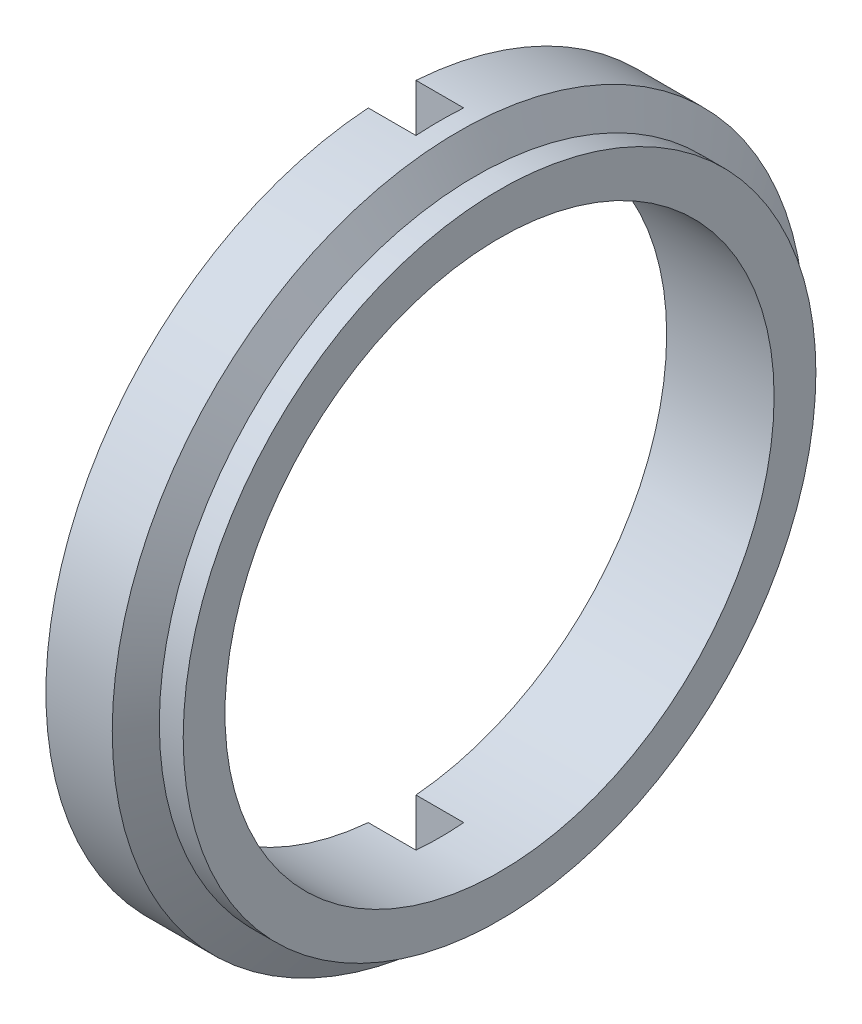
ISO-10303-21;
HEADER;
FILE_DESCRIPTION(('STEP AP214'),'2;1');
FILE_NAME('part.step','',(''),(''),'','','');
FILE_SCHEMA(('AUTOMOTIVE_DESIGN { 1 0 10303 214 1 1 1 1 }'));
ENDSEC;
DATA;
#1=APPLICATION_CONTEXT('core data for automotive mechanical design processes');
#2=APPLICATION_PROTOCOL_DEFINITION('international standard','automotive_design',2000,#1);
#3=PRODUCT_CONTEXT('',#1,'mechanical');
#4=PRODUCT('Part','Part','',(#3));
#5=PRODUCT_RELATED_PRODUCT_CATEGORY('part','',(#4));
#6=PRODUCT_DEFINITION_FORMATION('','',#4);
#7=PRODUCT_DEFINITION_CONTEXT('part definition',#1,'design');
#8=PRODUCT_DEFINITION('design','',#6,#7);
#9=PRODUCT_DEFINITION_SHAPE('','',#8);
#10=(LENGTH_UNIT() NAMED_UNIT(*) SI_UNIT(.MILLI.,.METRE.));
#11=(NAMED_UNIT(*) PLANE_ANGLE_UNIT() SI_UNIT($,.RADIAN.));
#12=(NAMED_UNIT(*) SI_UNIT($,.STERADIAN.) SOLID_ANGLE_UNIT());
#13=UNCERTAINTY_MEASURE_WITH_UNIT(LENGTH_MEASURE(1.E-05),#10,'distance_accuracy_value','');
#14=(GEOMETRIC_REPRESENTATION_CONTEXT(3) GLOBAL_UNCERTAINTY_ASSIGNED_CONTEXT((#13)) GLOBAL_UNIT_ASSIGNED_CONTEXT((#10,
#11,#12)) REPRESENTATION_CONTEXT('',''));
#15=CARTESIAN_POINT('',(0.,0.,0.));
#16=DIRECTION('',(0.,0.,1.));
#17=DIRECTION('',(1.,0.,0.));
#18=AXIS2_PLACEMENT_3D('',#15,#16,#17);
#19=CARTESIAN_POINT('',(-4.5,11.5,0.));
#20=DIRECTION('',(-1.,0.,0.));
#21=DIRECTION('',(0.,0.,1.));
#22=AXIS2_PLACEMENT_3D('',#19,#20,#21);
#23=PLANE('',#22);
#24=DIRECTION('',(0.,-1.,0.));
#25=VECTOR('',#24,1.);
#26=CARTESIAN_POINT('',(-4.5,-15.0577473688367,-0.999999999999998));
#27=LINE('',#26,#25);
#28=CARTESIAN_POINT('',(-4.5,14.4654761414894,-1.));
#29=VERTEX_POINT('',#28);
#30=CARTESIAN_POINT('',(-4.5,11.4564392373896,-1.));
#31=VERTEX_POINT('',#30);
#32=EDGE_CURVE('E97',#29,#31,#27,.T.);
#33=ORIENTED_EDGE('',*,*,#32,.F.);
#34=CARTESIAN_POINT('',(-4.5,0.,0.));
#35=DIRECTION('',(1.,0.,0.));
#36=DIRECTION('',(0.,0.,-1.));
#37=AXIS2_PLACEMENT_3D('',#34,#35,#36);
#38=CIRCLE('',#37,14.5);
#39=CARTESIAN_POINT('',(-4.5,-14.4654761414894,-0.999999999999998));
#40=VERTEX_POINT('',#39);
#41=EDGE_CURVE('E111',#40,#29,#38,.T.);
#42=ORIENTED_EDGE('',*,*,#41,.F.);
#43=CARTESIAN_POINT('',(-4.5,-11.4564392373896,-0.999999999999999));
#44=VERTEX_POINT('',#43);
#45=EDGE_CURVE('E115',#44,#40,#27,.T.);
#46=ORIENTED_EDGE('',*,*,#45,.F.);
#47=CARTESIAN_POINT('',(-4.5,0.,0.));
#48=DIRECTION('',(1.,0.,0.));
#49=DIRECTION('',(0.,0.,-1.));
#50=AXIS2_PLACEMENT_3D('',#47,#48,#49);
#51=CIRCLE('',#50,11.5);
#52=EDGE_CURVE('E113',#44,#31,#51,.T.);
#53=ORIENTED_EDGE('',*,*,#52,.T.);
#54=EDGE_LOOP('',(#33,#42,#46,#53));
#55=FACE_BOUND('',#54,.T.);
#56=ADVANCED_FACE('F30',(#55),#23,.T.);
#57=CARTESIAN_POINT('',(0.,13.25,0.));
#58=DIRECTION('',(1.,0.,0.));
#59=DIRECTION('',(0.,0.,-1.));
#60=AXIS2_PLACEMENT_3D('',#57,#58,#59);
#61=PLANE('',#60);
#62=CARTESIAN_POINT('',(0.,0.,0.));
#63=DIRECTION('',(1.,0.,0.));
#64=DIRECTION('',(0.,0.,-1.));
#65=AXIS2_PLACEMENT_3D('',#62,#63,#64);
#66=CIRCLE('',#65,13.25);
#67=CARTESIAN_POINT('',(0.,0.,-13.25));
#68=VERTEX_POINT('',#67);
#69=EDGE_CURVE('E170',#68,#68,#66,.T.);
#70=ORIENTED_EDGE('',*,*,#69,.T.);
#71=EDGE_LOOP('',(#70));
#72=FACE_BOUND('',#71,.T.);
#73=CARTESIAN_POINT('',(0.,0.,0.));
#74=DIRECTION('',(1.,0.,0.));
#75=DIRECTION('',(0.,0.,-1.));
#76=AXIS2_PLACEMENT_3D('',#73,#74,#75);
#77=CIRCLE('',#76,11.5);
#78=CARTESIAN_POINT('',(0.,0.,-11.5));
#79=VERTEX_POINT('',#78);
#80=EDGE_CURVE('E132',#79,#79,#77,.T.);
#81=ORIENTED_EDGE('',*,*,#80,.F.);
#82=EDGE_LOOP('',(#81));
#83=FACE_BOUND('',#82,.T.);
#84=ADVANCED_FACE('F32',(#72,#83),#61,.T.);
#85=CARTESIAN_POINT('',(0.,0.,0.));
#86=DIRECTION('',(1.,0.,0.));
#87=DIRECTION('',(0.,0.,-1.));
#88=AXIS2_PLACEMENT_3D('',#85,#86,#87);
#89=CYLINDRICAL_SURFACE('',#88,11.5);
#90=DIRECTION('',(1.,0.,0.));
#91=VECTOR('',#90,1.);
#92=CARTESIAN_POINT('',(0.,11.4564392373896,-1.));
#93=LINE('',#92,#91);
#94=CARTESIAN_POINT('',(-2.5,11.4564392373896,-1.));
#95=VERTEX_POINT('',#94);
#96=EDGE_CURVE('E168',#31,#95,#93,.T.);
#97=ORIENTED_EDGE('',*,*,#96,.F.);
#98=ORIENTED_EDGE('',*,*,#52,.F.);
#99=DIRECTION('',(1.,0.,0.));
#100=VECTOR('',#99,1.);
#101=CARTESIAN_POINT('',(0.,-11.4564392373896,-0.999999999999999));
#102=LINE('',#101,#100);
#103=CARTESIAN_POINT('',(-2.5,-11.4564392373896,-0.999999999999999));
#104=VERTEX_POINT('',#103);
#105=EDGE_CURVE('E166',#104,#44,#102,.F.);
#106=ORIENTED_EDGE('',*,*,#105,.F.);
#107=CARTESIAN_POINT('',(-2.5,0.,0.));
#108=DIRECTION('',(1.,0.,0.));
#109=DIRECTION('',(0.,0.,-1.));
#110=AXIS2_PLACEMENT_3D('',#107,#108,#109);
#111=CIRCLE('',#110,11.5);
#112=CARTESIAN_POINT('',(-2.5,-11.4564392373896,1.));
#113=VERTEX_POINT('',#112);
#114=EDGE_CURVE('E148',#113,#104,#111,.T.);
#115=ORIENTED_EDGE('',*,*,#114,.F.);
#116=DIRECTION('',(1.,0.,0.));
#117=VECTOR('',#116,1.);
#118=CARTESIAN_POINT('',(0.,-11.4564392373896,1.));
#119=LINE('',#118,#117);
#120=CARTESIAN_POINT('',(-4.5,-11.4564392373896,1.));
#121=VERTEX_POINT('',#120);
#122=EDGE_CURVE('E147',#121,#113,#119,.T.);
#123=ORIENTED_EDGE('',*,*,#122,.F.);
#124=CARTESIAN_POINT('',(-4.5,11.4564392373896,0.999999999999999));
#125=VERTEX_POINT('',#124);
#126=EDGE_CURVE('E131',#125,#121,#51,.T.);
#127=ORIENTED_EDGE('',*,*,#126,.F.);
#128=DIRECTION('',(1.,0.,0.));
#129=VECTOR('',#128,1.);
#130=CARTESIAN_POINT('',(0.,11.4564392373896,0.999999999999999));
#131=LINE('',#130,#129);
#132=CARTESIAN_POINT('',(-2.5,11.4564392373896,0.999999999999999));
#133=VERTEX_POINT('',#132);
#134=EDGE_CURVE('E163',#133,#125,#131,.F.);
#135=ORIENTED_EDGE('',*,*,#134,.F.);
#136=EDGE_CURVE('E162',#95,#133,#111,.T.);
#137=ORIENTED_EDGE('',*,*,#136,.F.);
#138=EDGE_LOOP('',(#97,#98,#106,#115,#123,#127,#135,#137));
#139=FACE_BOUND('',#138,.T.);
#140=ORIENTED_EDGE('',*,*,#80,.T.);
#141=EDGE_LOOP('',(#140));
#142=FACE_BOUND('',#141,.T.);
#143=ADVANCED_FACE('F194',(#139,#142),#89,.F.);
#144=DIRECTION('',(0.,1.,0.));
#145=VECTOR('',#144,1.);
#146=CARTESIAN_POINT('',(-4.5,14.8372825464526,0.999999999999998));
#147=LINE('',#146,#145);
#148=CARTESIAN_POINT('',(-4.5,-14.4654761414894,1.));
#149=VERTEX_POINT('',#148);
#150=EDGE_CURVE('E157',#149,#121,#147,.T.);
#151=ORIENTED_EDGE('',*,*,#150,.F.);
#152=CARTESIAN_POINT('',(-4.5,14.4654761414894,0.999999999999998));
#153=VERTEX_POINT('',#152);
#154=EDGE_CURVE('E121',#153,#149,#38,.T.);
#155=ORIENTED_EDGE('',*,*,#154,.F.);
#156=EDGE_CURVE('E114',#125,#153,#147,.T.);
#157=ORIENTED_EDGE('',*,*,#156,.F.);
#158=ORIENTED_EDGE('',*,*,#126,.T.);
#159=EDGE_LOOP('',(#151,#155,#157,#158));
#160=FACE_BOUND('',#159,.T.);
#161=ADVANCED_FACE('F154',(#160),#23,.T.);
#162=CARTESIAN_POINT('',(0.,0.,0.));
#163=DIRECTION('',(1.,0.,0.));
#164=DIRECTION('',(0.,0.,-1.));
#165=AXIS2_PLACEMENT_3D('',#162,#163,#164);
#166=CYLINDRICAL_SURFACE('',#165,14.5);
#167=DIRECTION('',(1.,0.,0.));
#168=VECTOR('',#167,1.);
#169=CARTESIAN_POINT('',(0.,-14.4654761414894,-0.999999999999998));
#170=LINE('',#169,#168);
#171=CARTESIAN_POINT('',(-2.5,-14.4654761414894,-0.999999999999998));
#172=VERTEX_POINT('',#171);
#173=EDGE_CURVE('E11',#40,#172,#170,.T.);
#174=ORIENTED_EDGE('',*,*,#173,.F.);
#175=ORIENTED_EDGE('',*,*,#41,.T.);
#176=DIRECTION('',(1.,0.,0.));
#177=VECTOR('',#176,1.);
#178=CARTESIAN_POINT('',(0.,14.4654761414894,-1.));
#179=LINE('',#178,#177);
#180=CARTESIAN_POINT('',(-2.5,14.4654761414894,-1.));
#181=VERTEX_POINT('',#180);
#182=EDGE_CURVE('E94',#181,#29,#179,.F.);
#183=ORIENTED_EDGE('',*,*,#182,.F.);
#184=CARTESIAN_POINT('',(-2.5,0.,0.));
#185=DIRECTION('',(1.,0.,0.));
#186=DIRECTION('',(0.,0.,-1.));
#187=AXIS2_PLACEMENT_3D('',#184,#185,#186);
#188=CIRCLE('',#187,14.5);
#189=CARTESIAN_POINT('',(-2.5,14.4654761414894,0.999999999999998));
#190=VERTEX_POINT('',#189);
#191=EDGE_CURVE('E135',#190,#181,#188,.F.);
#192=ORIENTED_EDGE('',*,*,#191,.F.);
#193=DIRECTION('',(1.,0.,0.));
#194=VECTOR('',#193,1.);
#195=CARTESIAN_POINT('',(0.,14.4654761414894,0.999999999999998));
#196=LINE('',#195,#194);
#197=EDGE_CURVE('E105',#153,#190,#196,.T.);
#198=ORIENTED_EDGE('',*,*,#197,.F.);
#199=ORIENTED_EDGE('',*,*,#154,.T.);
#200=DIRECTION('',(1.,0.,0.));
#201=VECTOR('',#200,1.);
#202=CARTESIAN_POINT('',(0.,-14.4654761414894,1.));
#203=LINE('',#202,#201);
#204=CARTESIAN_POINT('',(-2.5,-14.4654761414894,1.));
#205=VERTEX_POINT('',#204);
#206=EDGE_CURVE('E38',#205,#149,#203,.F.);
#207=ORIENTED_EDGE('',*,*,#206,.F.);
#208=EDGE_CURVE('E104',#172,#205,#188,.F.);
#209=ORIENTED_EDGE('',*,*,#208,.F.);
#210=EDGE_LOOP('',(#174,#175,#183,#192,#198,#199,#207,#209));
#211=FACE_BOUND('',#210,.T.);
#212=CARTESIAN_POINT('',(-1.72168783648702,0.,0.));
#213=DIRECTION('',(1.,0.,0.));
#214=DIRECTION('',(0.,0.,-1.));
#215=AXIS2_PLACEMENT_3D('',#212,#213,#214);
#216=CIRCLE('',#215,14.5);
#217=CARTESIAN_POINT('',(-1.72168783648702,0.,-14.5));
#218=VERTEX_POINT('',#217);
#219=EDGE_CURVE('E122',#218,#218,#216,.T.);
#220=ORIENTED_EDGE('',*,*,#219,.F.);
#221=EDGE_LOOP('',(#220));
#222=FACE_BOUND('',#221,.T.);
#223=ADVANCED_FACE('F118',(#211,#222),#166,.T.);
#224=CARTESIAN_POINT('',(-1.,0.,0.));
#225=DIRECTION('',(-1.,0.,0.));
#226=DIRECTION('',(0.,0.,1.));
#227=AXIS2_PLACEMENT_3D('',#224,#225,#226);
#228=CONICAL_SURFACE('',#227,13.25,1.0471975511966);
#229=ORIENTED_EDGE('',*,*,#219,.T.);
#230=EDGE_LOOP('',(#229));
#231=FACE_BOUND('',#230,.T.);
#232=CARTESIAN_POINT('',(-1.,0.,0.));
#233=DIRECTION('',(1.,0.,0.));
#234=DIRECTION('',(0.,0.,-1.));
#235=AXIS2_PLACEMENT_3D('',#232,#233,#234);
#236=CIRCLE('',#235,13.25);
#237=CARTESIAN_POINT('',(-1.,0.,-13.25));
#238=VERTEX_POINT('',#237);
#239=EDGE_CURVE('E126',#238,#238,#236,.T.);
#240=ORIENTED_EDGE('',*,*,#239,.F.);
#241=EDGE_LOOP('',(#240));
#242=FACE_BOUND('',#241,.T.);
#243=ADVANCED_FACE('F178',(#231,#242),#228,.T.);
#244=CARTESIAN_POINT('',(0.,0.,0.));
#245=DIRECTION('',(1.,0.,0.));
#246=DIRECTION('',(0.,0.,-1.));
#247=AXIS2_PLACEMENT_3D('',#244,#245,#246);
#248=CYLINDRICAL_SURFACE('',#247,13.25);
#249=ORIENTED_EDGE('',*,*,#239,.T.);
#250=EDGE_LOOP('',(#249));
#251=FACE_BOUND('',#250,.T.);
#252=ORIENTED_EDGE('',*,*,#69,.F.);
#253=EDGE_LOOP('',(#252));
#254=FACE_BOUND('',#253,.T.);
#255=ADVANCED_FACE('F175',(#251,#254),#248,.T.);
#256=CARTESIAN_POINT('',(-2.5,14.8372825464526,-1.));
#257=DIRECTION('',(1.,0.,0.));
#258=DIRECTION('',(0.,0.,-1.));
#259=AXIS2_PLACEMENT_3D('',#256,#257,#258);
#260=PLANE('',#259);
#261=ORIENTED_EDGE('',*,*,#136,.T.);
#262=DIRECTION('',(0.,1.,0.));
#263=VECTOR('',#262,1.);
#264=CARTESIAN_POINT('',(-2.5,14.8372825464526,0.999999999999998));
#265=LINE('',#264,#263);
#266=EDGE_CURVE('E52',#133,#190,#265,.T.);
#267=ORIENTED_EDGE('',*,*,#266,.T.);
#268=ORIENTED_EDGE('',*,*,#191,.T.);
#269=DIRECTION('',(0.,-1.,0.));
#270=VECTOR('',#269,1.);
#271=CARTESIAN_POINT('',(-2.5,-15.0577473688367,-0.999999999999998));
#272=LINE('',#271,#270);
#273=EDGE_CURVE('E100',#181,#95,#272,.T.);
#274=ORIENTED_EDGE('',*,*,#273,.T.);
#275=EDGE_LOOP('',(#261,#267,#268,#274));
#276=FACE_BOUND('',#275,.T.);
#277=ADVANCED_FACE('F186',(#276),#260,.F.);
#278=CARTESIAN_POINT('',(-2.5,14.8372825464526,0.999999999999998));
#279=DIRECTION('',(0.,0.,1.));
#280=DIRECTION('',(0.,-1.,0.));
#281=AXIS2_PLACEMENT_3D('',#278,#279,#280);
#282=PLANE('',#281);
#283=ORIENTED_EDGE('',*,*,#134,.T.);
#284=ORIENTED_EDGE('',*,*,#156,.T.);
#285=ORIENTED_EDGE('',*,*,#197,.T.);
#286=ORIENTED_EDGE('',*,*,#266,.F.);
#287=EDGE_LOOP('',(#283,#284,#285,#286));
#288=FACE_BOUND('',#287,.T.);
#289=ADVANCED_FACE('F210',(#288),#282,.F.);
#290=CARTESIAN_POINT('',(-2.5,-15.0577473688367,-0.999999999999998));
#291=DIRECTION('',(0.,0.,-1.));
#292=DIRECTION('',(0.,1.,0.));
#293=AXIS2_PLACEMENT_3D('',#290,#291,#292);
#294=PLANE('',#293);
#295=ORIENTED_EDGE('',*,*,#96,.T.);
#296=ORIENTED_EDGE('',*,*,#273,.F.);
#297=ORIENTED_EDGE('',*,*,#182,.T.);
#298=ORIENTED_EDGE('',*,*,#32,.T.);
#299=EDGE_LOOP('',(#295,#296,#297,#298));
#300=FACE_BOUND('',#299,.T.);
#301=ADVANCED_FACE('F96',(#300),#294,.F.);
#302=ORIENTED_EDGE('',*,*,#122,.T.);
#303=EDGE_CURVE('E143',#205,#113,#265,.T.);
#304=ORIENTED_EDGE('',*,*,#303,.F.);
#305=ORIENTED_EDGE('',*,*,#206,.T.);
#306=ORIENTED_EDGE('',*,*,#150,.T.);
#307=EDGE_LOOP('',(#302,#304,#305,#306));
#308=FACE_BOUND('',#307,.T.);
#309=ADVANCED_FACE('F145',(#308),#282,.F.);
#310=ORIENTED_EDGE('',*,*,#105,.T.);
#311=ORIENTED_EDGE('',*,*,#45,.T.);
#312=ORIENTED_EDGE('',*,*,#173,.T.);
#313=EDGE_CURVE('E45',#104,#172,#272,.T.);
#314=ORIENTED_EDGE('',*,*,#313,.F.);
#315=EDGE_LOOP('',(#310,#311,#312,#314));
#316=FACE_BOUND('',#315,.T.);
#317=ADVANCED_FACE('F212',(#316),#294,.F.);
#318=ORIENTED_EDGE('',*,*,#114,.T.);
#319=ORIENTED_EDGE('',*,*,#313,.T.);
#320=ORIENTED_EDGE('',*,*,#208,.T.);
#321=ORIENTED_EDGE('',*,*,#303,.T.);
#322=EDGE_LOOP('',(#318,#319,#320,#321));
#323=FACE_BOUND('',#322,.T.);
#324=ADVANCED_FACE('F142',(#323),#260,.F.);
#325=CLOSED_SHELL('',(#56,#84,#143,#161,#223,#243,#255,#277,#289,#301,#309,#317,#324));
#326=MANIFOLD_SOLID_BREP('B2',#325);
#327=ADVANCED_BREP_SHAPE_REPRESENTATION('',(#18,#326),#14);
#328=SHAPE_DEFINITION_REPRESENTATION(#9,#327);
ENDSEC;
END-ISO-10303-21;
